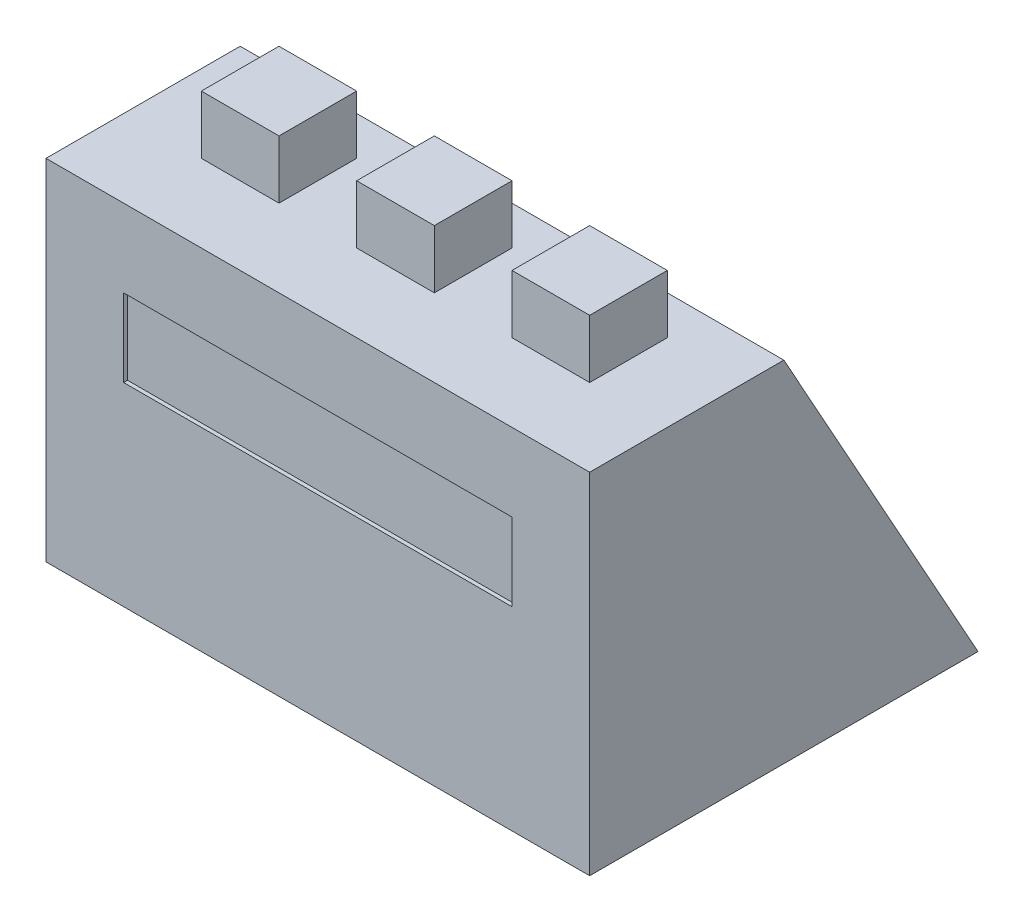
ISO-10303-21;
HEADER;
FILE_DESCRIPTION(('STEP AP214'),'2;1');
FILE_NAME('part.step','',(''),(''),'','','');
FILE_SCHEMA(('AUTOMOTIVE_DESIGN { 1 0 10303 214 1 1 1 1 }'));
ENDSEC;
DATA;
#1=APPLICATION_CONTEXT('core data for automotive mechanical design processes');
#2=APPLICATION_PROTOCOL_DEFINITION('international standard','automotive_design',2000,#1);
#3=PRODUCT_CONTEXT('',#1,'mechanical');
#4=PRODUCT('Part','Part','',(#3));
#5=PRODUCT_RELATED_PRODUCT_CATEGORY('part','',(#4));
#6=PRODUCT_DEFINITION_FORMATION('','',#4);
#7=PRODUCT_DEFINITION_CONTEXT('part definition',#1,'design');
#8=PRODUCT_DEFINITION('design','',#6,#7);
#9=PRODUCT_DEFINITION_SHAPE('','',#8);
#10=(LENGTH_UNIT() NAMED_UNIT(*) SI_UNIT(.MILLI.,.METRE.));
#11=(NAMED_UNIT(*) PLANE_ANGLE_UNIT() SI_UNIT($,.RADIAN.));
#12=(NAMED_UNIT(*) SI_UNIT($,.STERADIAN.) SOLID_ANGLE_UNIT());
#13=UNCERTAINTY_MEASURE_WITH_UNIT(LENGTH_MEASURE(1.E-05),#10,'distance_accuracy_value','');
#14=(GEOMETRIC_REPRESENTATION_CONTEXT(3) GLOBAL_UNCERTAINTY_ASSIGNED_CONTEXT((#13)) GLOBAL_UNIT_ASSIGNED_CONTEXT((#10,
#11,#12)) REPRESENTATION_CONTEXT('',''));
#15=CARTESIAN_POINT('',(0.,0.,0.));
#16=DIRECTION('',(0.,0.,1.));
#17=DIRECTION('',(1.,0.,0.));
#18=AXIS2_PLACEMENT_3D('',#15,#16,#17);
#19=CARTESIAN_POINT('',(100.,105.,-140.772299585195));
#20=DIRECTION('',(-1.,0.,0.));
#21=DIRECTION('',(0.,0.,1.));
#22=AXIS2_PLACEMENT_3D('',#19,#20,#21);
#23=PLANE('',#22);
#24=DIRECTION('',(0.,0.,-1.));
#25=VECTOR('',#24,1.);
#26=CARTESIAN_POINT('',(100.,90.,-140.772299585195));
#27=LINE('',#26,#25);
#28=CARTESIAN_POINT('',(100.,90.,-20.));
#29=VERTEX_POINT('',#28);
#30=CARTESIAN_POINT('',(100.,90.,-40.));
#31=VERTEX_POINT('',#30);
#32=EDGE_CURVE('E97',#29,#31,#27,.T.);
#33=ORIENTED_EDGE('',*,*,#32,.F.);
#34=DIRECTION('',(0.,-1.,0.));
#35=VECTOR('',#34,1.);
#36=CARTESIAN_POINT('',(100.,105.,-20.));
#37=LINE('',#36,#35);
#38=CARTESIAN_POINT('',(100.,105.,-20.));
#39=VERTEX_POINT('',#38);
#40=EDGE_CURVE('E12',#39,#29,#37,.T.);
#41=ORIENTED_EDGE('',*,*,#40,.F.);
#42=DIRECTION('',(0.,0.,-1.));
#43=VECTOR('',#42,1.);
#44=CARTESIAN_POINT('',(100.,105.,-140.772299585195));
#45=LINE('',#44,#43);
#46=CARTESIAN_POINT('',(100.,105.,-40.));
#47=VERTEX_POINT('',#46);
#48=EDGE_CURVE('E106',#39,#47,#45,.T.);
#49=ORIENTED_EDGE('',*,*,#48,.T.);
#50=DIRECTION('',(0.,-1.,0.));
#51=VECTOR('',#50,1.);
#52=CARTESIAN_POINT('',(100.,105.,-40.));
#53=LINE('',#52,#51);
#54=EDGE_CURVE('E57',#47,#31,#53,.T.);
#55=ORIENTED_EDGE('',*,*,#54,.T.);
#56=EDGE_LOOP('',(#33,#41,#49,#55));
#57=FACE_BOUND('',#56,.T.);
#58=ADVANCED_FACE('F43',(#57),#23,.T.);
#59=CARTESIAN_POINT('',(70.,105.,-20.));
#60=DIRECTION('',(0.,0.,-1.));
#61=DIRECTION('',(-1.,0.,0.));
#62=AXIS2_PLACEMENT_3D('',#59,#60,#61);
#63=PLANE('',#62);
#64=DIRECTION('',(1.,0.,0.));
#65=VECTOR('',#64,1.);
#66=CARTESIAN_POINT('',(70.,90.,-20.));
#67=LINE('',#66,#65);
#68=CARTESIAN_POINT('',(120.,90.,-20.));
#69=VERTEX_POINT('',#68);
#70=EDGE_CURVE('E86',#29,#69,#67,.T.);
#71=ORIENTED_EDGE('',*,*,#70,.T.);
#72=DIRECTION('',(0.,-1.,0.));
#73=VECTOR('',#72,1.);
#74=CARTESIAN_POINT('',(120.,105.,-20.));
#75=LINE('',#74,#73);
#76=CARTESIAN_POINT('',(120.,105.,-20.));
#77=VERTEX_POINT('',#76);
#78=EDGE_CURVE('E50',#77,#69,#75,.T.);
#79=ORIENTED_EDGE('',*,*,#78,.F.);
#80=DIRECTION('',(1.,0.,0.));
#81=VECTOR('',#80,1.);
#82=CARTESIAN_POINT('',(70.,105.,-20.));
#83=LINE('',#82,#81);
#84=EDGE_CURVE('E88',#39,#77,#83,.T.);
#85=ORIENTED_EDGE('',*,*,#84,.F.);
#86=ORIENTED_EDGE('',*,*,#40,.T.);
#87=EDGE_LOOP('',(#71,#79,#85,#86));
#88=FACE_BOUND('',#87,.T.);
#89=ADVANCED_FACE('F84',(#88),#63,.F.);
#90=CARTESIAN_POINT('',(120.,105.,-140.772299585195));
#91=DIRECTION('',(-1.,0.,0.));
#92=DIRECTION('',(0.,0.,1.));
#93=AXIS2_PLACEMENT_3D('',#90,#91,#92);
#94=PLANE('',#93);
#95=DIRECTION('',(0.,0.,-1.));
#96=VECTOR('',#95,1.);
#97=CARTESIAN_POINT('',(120.,90.,-140.772299585195));
#98=LINE('',#97,#96);
#99=CARTESIAN_POINT('',(120.,90.,-40.));
#100=VERTEX_POINT('',#99);
#101=EDGE_CURVE('E99',#69,#100,#98,.T.);
#102=ORIENTED_EDGE('',*,*,#101,.T.);
#103=DIRECTION('',(0.,-1.,0.));
#104=VECTOR('',#103,1.);
#105=CARTESIAN_POINT('',(120.,105.,-40.));
#106=LINE('',#105,#104);
#107=CARTESIAN_POINT('',(120.,105.,-40.));
#108=VERTEX_POINT('',#107);
#109=EDGE_CURVE('E113',#108,#100,#106,.T.);
#110=ORIENTED_EDGE('',*,*,#109,.F.);
#111=DIRECTION('',(0.,0.,-1.));
#112=VECTOR('',#111,1.);
#113=CARTESIAN_POINT('',(120.,105.,-140.772299585195));
#114=LINE('',#113,#112);
#115=EDGE_CURVE('E65',#77,#108,#114,.T.);
#116=ORIENTED_EDGE('',*,*,#115,.F.);
#117=ORIENTED_EDGE('',*,*,#78,.T.);
#118=EDGE_LOOP('',(#102,#110,#116,#117));
#119=FACE_BOUND('',#118,.T.);
#120=ADVANCED_FACE('F115',(#119),#94,.F.);
#121=CARTESIAN_POINT('',(70.,105.,-40.));
#122=DIRECTION('',(0.,0.,-1.));
#123=DIRECTION('',(-1.,0.,0.));
#124=AXIS2_PLACEMENT_3D('',#121,#122,#123);
#125=PLANE('',#124);
#126=DIRECTION('',(1.,0.,0.));
#127=VECTOR('',#126,1.);
#128=CARTESIAN_POINT('',(70.,90.,-40.));
#129=LINE('',#128,#127);
#130=EDGE_CURVE('E104',#31,#100,#129,.T.);
#131=ORIENTED_EDGE('',*,*,#130,.F.);
#132=ORIENTED_EDGE('',*,*,#54,.F.);
#133=DIRECTION('',(1.,0.,0.));
#134=VECTOR('',#133,1.);
#135=CARTESIAN_POINT('',(70.,105.,-40.));
#136=LINE('',#135,#134);
#137=EDGE_CURVE('E110',#47,#108,#136,.T.);
#138=ORIENTED_EDGE('',*,*,#137,.T.);
#139=ORIENTED_EDGE('',*,*,#109,.T.);
#140=EDGE_LOOP('',(#131,#132,#138,#139));
#141=FACE_BOUND('',#140,.T.);
#142=ADVANCED_FACE('F116',(#141),#125,.T.);
#143=CARTESIAN_POINT('',(70.,105.,-140.772299585195));
#144=DIRECTION('',(0.,-1.,0.));
#145=DIRECTION('',(0.,0.,-1.));
#146=AXIS2_PLACEMENT_3D('',#143,#144,#145);
#147=PLANE('',#146);
#148=ORIENTED_EDGE('',*,*,#48,.F.);
#149=ORIENTED_EDGE('',*,*,#84,.T.);
#150=ORIENTED_EDGE('',*,*,#115,.T.);
#151=ORIENTED_EDGE('',*,*,#137,.F.);
#152=EDGE_LOOP('',(#148,#149,#150,#151));
#153=FACE_BOUND('',#152,.T.);
#154=ADVANCED_FACE('F117',(#153),#147,.F.);
#155=CARTESIAN_POINT('',(70.,90.,-140.772299585195));
#156=DIRECTION('',(0.,-1.,0.));
#157=DIRECTION('',(0.,0.,-1.));
#158=AXIS2_PLACEMENT_3D('',#155,#156,#157);
#159=PLANE('',#158);
#160=ORIENTED_EDGE('',*,*,#32,.T.);
#161=ORIENTED_EDGE('',*,*,#130,.T.);
#162=ORIENTED_EDGE('',*,*,#101,.F.);
#163=ORIENTED_EDGE('',*,*,#70,.F.);
#164=EDGE_LOOP('',(#160,#161,#162,#163));
#165=FACE_BOUND('',#164,.T.);
#166=ADVANCED_FACE('F95',(#165),#159,.T.);
#167=CLOSED_SHELL('',(#58,#89,#120,#142,#154,#166));
#168=MANIFOLD_SOLID_BREP('B2',#167);
#169=CARTESIAN_POINT('',(70.,105.,-40.));
#170=DIRECTION('',(0.,0.,-1.));
#171=DIRECTION('',(-1.,0.,0.));
#172=AXIS2_PLACEMENT_3D('',#169,#170,#171);
#173=PLANE('',#172);
#174=DIRECTION('',(1.,0.,0.));
#175=VECTOR('',#174,1.);
#176=CARTESIAN_POINT('',(70.,90.,-40.));
#177=LINE('',#176,#175);
#178=CARTESIAN_POINT('',(60.,90.,-40.));
#179=VERTEX_POINT('',#178);
#180=CARTESIAN_POINT('',(80.,90.,-40.));
#181=VERTEX_POINT('',#180);
#182=EDGE_CURVE('E224',#179,#181,#177,.T.);
#183=ORIENTED_EDGE('',*,*,#182,.F.);
#184=DIRECTION('',(0.,-1.,0.));
#185=VECTOR('',#184,1.);
#186=CARTESIAN_POINT('',(60.,105.,-40.));
#187=LINE('',#186,#185);
#188=CARTESIAN_POINT('',(60.,105.,-40.));
#189=VERTEX_POINT('',#188);
#190=EDGE_CURVE('E41',#189,#179,#187,.T.);
#191=ORIENTED_EDGE('',*,*,#190,.F.);
#192=DIRECTION('',(1.,0.,0.));
#193=VECTOR('',#192,1.);
#194=CARTESIAN_POINT('',(70.,105.,-40.));
#195=LINE('',#194,#193);
#196=CARTESIAN_POINT('',(80.,105.,-40.));
#197=VERTEX_POINT('',#196);
#198=EDGE_CURVE('E238',#189,#197,#195,.T.);
#199=ORIENTED_EDGE('',*,*,#198,.T.);
#200=DIRECTION('',(0.,-1.,0.));
#201=VECTOR('',#200,1.);
#202=CARTESIAN_POINT('',(80.,105.,-40.));
#203=LINE('',#202,#201);
#204=EDGE_CURVE('E225',#197,#181,#203,.T.);
#205=ORIENTED_EDGE('',*,*,#204,.T.);
#206=EDGE_LOOP('',(#183,#191,#199,#205));
#207=FACE_BOUND('',#206,.T.);
#208=ADVANCED_FACE('F176',(#207),#173,.T.);
#209=CARTESIAN_POINT('',(60.,105.,-140.772299585195));
#210=DIRECTION('',(-1.,0.,0.));
#211=DIRECTION('',(0.,0.,1.));
#212=AXIS2_PLACEMENT_3D('',#209,#210,#211);
#213=PLANE('',#212);
#214=DIRECTION('',(0.,0.,-1.));
#215=VECTOR('',#214,1.);
#216=CARTESIAN_POINT('',(60.,90.,-140.772299585195));
#217=LINE('',#216,#215);
#218=CARTESIAN_POINT('',(60.,90.,-20.));
#219=VERTEX_POINT('',#218);
#220=EDGE_CURVE('E219',#219,#179,#217,.T.);
#221=ORIENTED_EDGE('',*,*,#220,.F.);
#222=DIRECTION('',(0.,-1.,0.));
#223=VECTOR('',#222,1.);
#224=CARTESIAN_POINT('',(60.,105.,-20.));
#225=LINE('',#224,#223);
#226=CARTESIAN_POINT('',(60.,105.,-20.));
#227=VERTEX_POINT('',#226);
#228=EDGE_CURVE('E183',#227,#219,#225,.T.);
#229=ORIENTED_EDGE('',*,*,#228,.F.);
#230=DIRECTION('',(0.,0.,-1.));
#231=VECTOR('',#230,1.);
#232=CARTESIAN_POINT('',(60.,105.,-140.772299585195));
#233=LINE('',#232,#231);
#234=EDGE_CURVE('E220',#227,#189,#233,.T.);
#235=ORIENTED_EDGE('',*,*,#234,.T.);
#236=ORIENTED_EDGE('',*,*,#190,.T.);
#237=EDGE_LOOP('',(#221,#229,#235,#236));
#238=FACE_BOUND('',#237,.T.);
#239=ADVANCED_FACE('F217',(#238),#213,.T.);
#240=CARTESIAN_POINT('',(70.,105.,-20.));
#241=DIRECTION('',(0.,0.,-1.));
#242=DIRECTION('',(-1.,0.,0.));
#243=AXIS2_PLACEMENT_3D('',#240,#241,#242);
#244=PLANE('',#243);
#245=DIRECTION('',(1.,0.,0.));
#246=VECTOR('',#245,1.);
#247=CARTESIAN_POINT('',(70.,90.,-20.));
#248=LINE('',#247,#246);
#249=CARTESIAN_POINT('',(80.,90.,-20.));
#250=VERTEX_POINT('',#249);
#251=EDGE_CURVE('E232',#219,#250,#248,.T.);
#252=ORIENTED_EDGE('',*,*,#251,.T.);
#253=DIRECTION('',(0.,-1.,0.));
#254=VECTOR('',#253,1.);
#255=CARTESIAN_POINT('',(80.,105.,-20.));
#256=LINE('',#255,#254);
#257=CARTESIAN_POINT('',(80.,105.,-20.));
#258=VERTEX_POINT('',#257);
#259=EDGE_CURVE('E244',#258,#250,#256,.T.);
#260=ORIENTED_EDGE('',*,*,#259,.F.);
#261=DIRECTION('',(1.,0.,0.));
#262=VECTOR('',#261,1.);
#263=CARTESIAN_POINT('',(70.,105.,-20.));
#264=LINE('',#263,#262);
#265=EDGE_CURVE('E195',#227,#258,#264,.T.);
#266=ORIENTED_EDGE('',*,*,#265,.F.);
#267=ORIENTED_EDGE('',*,*,#228,.T.);
#268=EDGE_LOOP('',(#252,#260,#266,#267));
#269=FACE_BOUND('',#268,.T.);
#270=ADVANCED_FACE('F247',(#269),#244,.F.);
#271=CARTESIAN_POINT('',(80.,105.,-140.772299585195));
#272=DIRECTION('',(-1.,0.,0.));
#273=DIRECTION('',(0.,0.,1.));
#274=AXIS2_PLACEMENT_3D('',#271,#272,#273);
#275=PLANE('',#274);
#276=DIRECTION('',(0.,0.,-1.));
#277=VECTOR('',#276,1.);
#278=CARTESIAN_POINT('',(80.,90.,-140.772299585195));
#279=LINE('',#278,#277);
#280=EDGE_CURVE('E234',#250,#181,#279,.T.);
#281=ORIENTED_EDGE('',*,*,#280,.T.);
#282=ORIENTED_EDGE('',*,*,#204,.F.);
#283=DIRECTION('',(0.,0.,-1.));
#284=VECTOR('',#283,1.);
#285=CARTESIAN_POINT('',(80.,105.,-140.772299585195));
#286=LINE('',#285,#284);
#287=EDGE_CURVE('E190',#258,#197,#286,.T.);
#288=ORIENTED_EDGE('',*,*,#287,.F.);
#289=ORIENTED_EDGE('',*,*,#259,.T.);
#290=EDGE_LOOP('',(#281,#282,#288,#289));
#291=FACE_BOUND('',#290,.T.);
#292=ADVANCED_FACE('F250',(#291),#275,.F.);
#293=CARTESIAN_POINT('',(70.,105.,-140.772299585195));
#294=DIRECTION('',(0.,-1.,0.));
#295=DIRECTION('',(0.,0.,-1.));
#296=AXIS2_PLACEMENT_3D('',#293,#294,#295);
#297=PLANE('',#296);
#298=ORIENTED_EDGE('',*,*,#198,.F.);
#299=ORIENTED_EDGE('',*,*,#234,.F.);
#300=ORIENTED_EDGE('',*,*,#265,.T.);
#301=ORIENTED_EDGE('',*,*,#287,.T.);
#302=EDGE_LOOP('',(#298,#299,#300,#301));
#303=FACE_BOUND('',#302,.T.);
#304=ADVANCED_FACE('F248',(#303),#297,.F.);
#305=CARTESIAN_POINT('',(70.,90.,-140.772299585195));
#306=DIRECTION('',(0.,-1.,0.));
#307=DIRECTION('',(0.,0.,-1.));
#308=AXIS2_PLACEMENT_3D('',#305,#306,#307);
#309=PLANE('',#308);
#310=ORIENTED_EDGE('',*,*,#182,.T.);
#311=ORIENTED_EDGE('',*,*,#280,.F.);
#312=ORIENTED_EDGE('',*,*,#251,.F.);
#313=ORIENTED_EDGE('',*,*,#220,.T.);
#314=EDGE_LOOP('',(#310,#311,#312,#313));
#315=FACE_BOUND('',#314,.T.);
#316=ADVANCED_FACE('F231',(#315),#309,.T.);
#317=CLOSED_SHELL('',(#208,#239,#270,#292,#304,#316));
#318=MANIFOLD_SOLID_BREP('B6',#317);
#319=CARTESIAN_POINT('',(70.,105.,-40.));
#320=DIRECTION('',(0.,0.,-1.));
#321=DIRECTION('',(-1.,0.,0.));
#322=AXIS2_PLACEMENT_3D('',#319,#320,#321);
#323=PLANE('',#322);
#324=DIRECTION('',(1.,0.,0.));
#325=VECTOR('',#324,1.);
#326=CARTESIAN_POINT('',(70.,90.,-40.));
#327=LINE('',#326,#325);
#328=CARTESIAN_POINT('',(20.,90.,-40.));
#329=VERTEX_POINT('',#328);
#330=CARTESIAN_POINT('',(40.,90.,-40.));
#331=VERTEX_POINT('',#330);
#332=EDGE_CURVE('E356',#329,#331,#327,.T.);
#333=ORIENTED_EDGE('',*,*,#332,.F.);
#334=DIRECTION('',(0.,-1.,0.));
#335=VECTOR('',#334,1.);
#336=CARTESIAN_POINT('',(20.,105.,-40.));
#337=LINE('',#336,#335);
#338=CARTESIAN_POINT('',(20.,105.,-40.));
#339=VERTEX_POINT('',#338);
#340=EDGE_CURVE('E174',#339,#329,#337,.T.);
#341=ORIENTED_EDGE('',*,*,#340,.F.);
#342=DIRECTION('',(1.,0.,0.));
#343=VECTOR('',#342,1.);
#344=CARTESIAN_POINT('',(70.,105.,-40.));
#345=LINE('',#344,#343);
#346=CARTESIAN_POINT('',(40.,105.,-40.));
#347=VERTEX_POINT('',#346);
#348=EDGE_CURVE('E370',#339,#347,#345,.T.);
#349=ORIENTED_EDGE('',*,*,#348,.T.);
#350=DIRECTION('',(0.,-1.,0.));
#351=VECTOR('',#350,1.);
#352=CARTESIAN_POINT('',(40.,105.,-40.));
#353=LINE('',#352,#351);
#354=EDGE_CURVE('E357',#347,#331,#353,.T.);
#355=ORIENTED_EDGE('',*,*,#354,.T.);
#356=EDGE_LOOP('',(#333,#341,#349,#355));
#357=FACE_BOUND('',#356,.T.);
#358=ADVANCED_FACE('F308',(#357),#323,.T.);
#359=CARTESIAN_POINT('',(19.9999999999999,105.,-140.772299585195));
#360=DIRECTION('',(-1.,0.,0.));
#361=DIRECTION('',(0.,0.,1.));
#362=AXIS2_PLACEMENT_3D('',#359,#360,#361);
#363=PLANE('',#362);
#364=DIRECTION('',(0.,0.,-1.));
#365=VECTOR('',#364,1.);
#366=CARTESIAN_POINT('',(19.9999999999999,90.,-140.772299585195));
#367=LINE('',#366,#365);
#368=CARTESIAN_POINT('',(20.,90.,-20.));
#369=VERTEX_POINT('',#368);
#370=EDGE_CURVE('E351',#369,#329,#367,.T.);
#371=ORIENTED_EDGE('',*,*,#370,.F.);
#372=DIRECTION('',(0.,-1.,0.));
#373=VECTOR('',#372,1.);
#374=CARTESIAN_POINT('',(20.,105.,-20.));
#375=LINE('',#374,#373);
#376=CARTESIAN_POINT('',(20.,105.,-20.));
#377=VERTEX_POINT('',#376);
#378=EDGE_CURVE('E315',#377,#369,#375,.T.);
#379=ORIENTED_EDGE('',*,*,#378,.F.);
#380=DIRECTION('',(0.,0.,-1.));
#381=VECTOR('',#380,1.);
#382=CARTESIAN_POINT('',(19.9999999999999,105.,-140.772299585195));
#383=LINE('',#382,#381);
#384=EDGE_CURVE('E352',#377,#339,#383,.T.);
#385=ORIENTED_EDGE('',*,*,#384,.T.);
#386=ORIENTED_EDGE('',*,*,#340,.T.);
#387=EDGE_LOOP('',(#371,#379,#385,#386));
#388=FACE_BOUND('',#387,.T.);
#389=ADVANCED_FACE('F349',(#388),#363,.T.);
#390=CARTESIAN_POINT('',(70.,105.,-20.));
#391=DIRECTION('',(0.,0.,-1.));
#392=DIRECTION('',(-1.,0.,0.));
#393=AXIS2_PLACEMENT_3D('',#390,#391,#392);
#394=PLANE('',#393);
#395=DIRECTION('',(1.,0.,0.));
#396=VECTOR('',#395,1.);
#397=CARTESIAN_POINT('',(70.,90.,-20.));
#398=LINE('',#397,#396);
#399=CARTESIAN_POINT('',(40.,90.,-20.));
#400=VERTEX_POINT('',#399);
#401=EDGE_CURVE('E364',#369,#400,#398,.T.);
#402=ORIENTED_EDGE('',*,*,#401,.T.);
#403=DIRECTION('',(0.,-1.,0.));
#404=VECTOR('',#403,1.);
#405=CARTESIAN_POINT('',(40.,105.,-20.));
#406=LINE('',#405,#404);
#407=CARTESIAN_POINT('',(40.,105.,-20.));
#408=VERTEX_POINT('',#407);
#409=EDGE_CURVE('E376',#408,#400,#406,.T.);
#410=ORIENTED_EDGE('',*,*,#409,.F.);
#411=DIRECTION('',(1.,0.,0.));
#412=VECTOR('',#411,1.);
#413=CARTESIAN_POINT('',(70.,105.,-20.));
#414=LINE('',#413,#412);
#415=EDGE_CURVE('E327',#377,#408,#414,.T.);
#416=ORIENTED_EDGE('',*,*,#415,.F.);
#417=ORIENTED_EDGE('',*,*,#378,.T.);
#418=EDGE_LOOP('',(#402,#410,#416,#417));
#419=FACE_BOUND('',#418,.T.);
#420=ADVANCED_FACE('F379',(#419),#394,.F.);
#421=CARTESIAN_POINT('',(40.,105.,-140.772299585195));
#422=DIRECTION('',(-1.,0.,0.));
#423=DIRECTION('',(0.,0.,1.));
#424=AXIS2_PLACEMENT_3D('',#421,#422,#423);
#425=PLANE('',#424);
#426=DIRECTION('',(0.,0.,-1.));
#427=VECTOR('',#426,1.);
#428=CARTESIAN_POINT('',(40.,90.,-140.772299585195));
#429=LINE('',#428,#427);
#430=EDGE_CURVE('E366',#400,#331,#429,.T.);
#431=ORIENTED_EDGE('',*,*,#430,.T.);
#432=ORIENTED_EDGE('',*,*,#354,.F.);
#433=DIRECTION('',(0.,0.,-1.));
#434=VECTOR('',#433,1.);
#435=CARTESIAN_POINT('',(40.,105.,-140.772299585195));
#436=LINE('',#435,#434);
#437=EDGE_CURVE('E322',#408,#347,#436,.T.);
#438=ORIENTED_EDGE('',*,*,#437,.F.);
#439=ORIENTED_EDGE('',*,*,#409,.T.);
#440=EDGE_LOOP('',(#431,#432,#438,#439));
#441=FACE_BOUND('',#440,.T.);
#442=ADVANCED_FACE('F382',(#441),#425,.F.);
#443=CARTESIAN_POINT('',(70.,105.,-140.772299585195));
#444=DIRECTION('',(0.,-1.,0.));
#445=DIRECTION('',(0.,0.,-1.));
#446=AXIS2_PLACEMENT_3D('',#443,#444,#445);
#447=PLANE('',#446);
#448=ORIENTED_EDGE('',*,*,#348,.F.);
#449=ORIENTED_EDGE('',*,*,#384,.F.);
#450=ORIENTED_EDGE('',*,*,#415,.T.);
#451=ORIENTED_EDGE('',*,*,#437,.T.);
#452=EDGE_LOOP('',(#448,#449,#450,#451));
#453=FACE_BOUND('',#452,.T.);
#454=ADVANCED_FACE('F380',(#453),#447,.F.);
#455=CARTESIAN_POINT('',(70.,90.,-140.772299585195));
#456=DIRECTION('',(0.,-1.,0.));
#457=DIRECTION('',(0.,0.,-1.));
#458=AXIS2_PLACEMENT_3D('',#455,#456,#457);
#459=PLANE('',#458);
#460=ORIENTED_EDGE('',*,*,#332,.T.);
#461=ORIENTED_EDGE('',*,*,#430,.F.);
#462=ORIENTED_EDGE('',*,*,#401,.F.);
#463=ORIENTED_EDGE('',*,*,#370,.T.);
#464=EDGE_LOOP('',(#460,#461,#462,#463));
#465=FACE_BOUND('',#464,.T.);
#466=ADVANCED_FACE('F363',(#465),#459,.T.);
#467=CLOSED_SHELL('',(#358,#389,#420,#442,#454,#466));
#468=MANIFOLD_SOLID_BREP('B35',#467);
#469=CARTESIAN_POINT('',(140.,90.,-50.));
#470=DIRECTION('',(0.,-1.,0.));
#471=DIRECTION('',(0.,0.,-1.));
#472=AXIS2_PLACEMENT_3D('',#469,#470,#471);
#473=PLANE('',#472);
#474=DIRECTION('',(0.,0.,1.));
#475=VECTOR('',#474,1.);
#476=CARTESIAN_POINT('',(0.,90.,-50.));
#477=LINE('',#476,#475);
#478=CARTESIAN_POINT('',(0.,90.,-50.));
#479=VERTEX_POINT('',#478);
#480=CARTESIAN_POINT('',(0.,90.,0.));
#481=VERTEX_POINT('',#480);
#482=EDGE_CURVE('E534',#479,#481,#477,.T.);
#483=ORIENTED_EDGE('',*,*,#482,.T.);
#484=DIRECTION('',(-1.,0.,0.));
#485=VECTOR('',#484,1.);
#486=CARTESIAN_POINT('',(140.,90.,0.));
#487=LINE('',#486,#485);
#488=CARTESIAN_POINT('',(140.,90.,0.));
#489=VERTEX_POINT('',#488);
#490=EDGE_CURVE('E306',#489,#481,#487,.T.);
#491=ORIENTED_EDGE('',*,*,#490,.F.);
#492=DIRECTION('',(0.,0.,1.));
#493=VECTOR('',#492,1.);
#494=CARTESIAN_POINT('',(140.,90.,-50.));
#495=LINE('',#494,#493);
#496=CARTESIAN_POINT('',(140.,90.,-50.));
#497=VERTEX_POINT('',#496);
#498=EDGE_CURVE('E545',#497,#489,#495,.T.);
#499=ORIENTED_EDGE('',*,*,#498,.F.);
#500=DIRECTION('',(-1.,0.,0.));
#501=VECTOR('',#500,1.);
#502=CARTESIAN_POINT('',(140.,90.,-50.));
#503=LINE('',#502,#501);
#504=EDGE_CURVE('E552',#497,#479,#503,.T.);
#505=ORIENTED_EDGE('',*,*,#504,.T.);
#506=EDGE_LOOP('',(#483,#491,#499,#505));
#507=FACE_BOUND('',#506,.T.);
#508=ADVANCED_FACE('F431',(#507),#473,.F.);
#509=CARTESIAN_POINT('',(140.,90.,0.));
#510=DIRECTION('',(0.,0.,-1.));
#511=DIRECTION('',(0.,1.,0.));
#512=AXIS2_PLACEMENT_3D('',#509,#510,#511);
#513=PLANE('',#512);
#514=DIRECTION('',(-1.,0.,0.));
#515=VECTOR('',#514,1.);
#516=CARTESIAN_POINT('',(20.,70.,0.));
#517=LINE('',#516,#515);
#518=CARTESIAN_POINT('',(120.,70.,0.));
#519=VERTEX_POINT('',#518);
#520=CARTESIAN_POINT('',(20.,70.,0.));
#521=VERTEX_POINT('',#520);
#522=EDGE_CURVE('E511',#519,#521,#517,.T.);
#523=ORIENTED_EDGE('',*,*,#522,.F.);
#524=DIRECTION('',(0.,1.,0.));
#525=VECTOR('',#524,1.);
#526=CARTESIAN_POINT('',(120.,50.,0.));
#527=LINE('',#526,#525);
#528=CARTESIAN_POINT('',(120.,50.,0.));
#529=VERTEX_POINT('',#528);
#530=EDGE_CURVE('E445',#529,#519,#527,.T.);
#531=ORIENTED_EDGE('',*,*,#530,.F.);
#532=DIRECTION('',(1.,0.,0.));
#533=VECTOR('',#532,1.);
#534=CARTESIAN_POINT('',(20.,50.,0.));
#535=LINE('',#534,#533);
#536=CARTESIAN_POINT('',(20.,50.,0.));
#537=VERTEX_POINT('',#536);
#538=EDGE_CURVE('E518',#537,#529,#535,.T.);
#539=ORIENTED_EDGE('',*,*,#538,.F.);
#540=DIRECTION('',(0.,-1.,0.));
#541=VECTOR('',#540,1.);
#542=CARTESIAN_POINT('',(20.,50.,0.));
#543=LINE('',#542,#541);
#544=EDGE_CURVE('E500',#521,#537,#543,.T.);
#545=ORIENTED_EDGE('',*,*,#544,.F.);
#546=EDGE_LOOP('',(#523,#531,#539,#545));
#547=FACE_BOUND('',#546,.T.);
#548=DIRECTION('',(0.,-1.,0.));
#549=VECTOR('',#548,1.);
#550=CARTESIAN_POINT('',(0.,90.,0.));
#551=LINE('',#550,#549);
#552=CARTESIAN_POINT('',(0.,0.,0.));
#553=VERTEX_POINT('',#552);
#554=EDGE_CURVE('E539',#481,#553,#551,.T.);
#555=ORIENTED_EDGE('',*,*,#554,.T.);
#556=DIRECTION('',(-1.,0.,0.));
#557=VECTOR('',#556,1.);
#558=CARTESIAN_POINT('',(140.,0.,0.));
#559=LINE('',#558,#557);
#560=CARTESIAN_POINT('',(140.,0.,0.));
#561=VERTEX_POINT('',#560);
#562=EDGE_CURVE('E438',#561,#553,#559,.T.);
#563=ORIENTED_EDGE('',*,*,#562,.F.);
#564=DIRECTION('',(0.,-1.,0.));
#565=VECTOR('',#564,1.);
#566=CARTESIAN_POINT('',(140.,90.,0.));
#567=LINE('',#566,#565);
#568=EDGE_CURVE('E547',#489,#561,#567,.T.);
#569=ORIENTED_EDGE('',*,*,#568,.F.);
#570=ORIENTED_EDGE('',*,*,#490,.T.);
#571=EDGE_LOOP('',(#555,#563,#569,#570));
#572=FACE_BOUND('',#571,.T.);
#573=ADVANCED_FACE('F515',(#547,#572),#513,.F.);
#574=CARTESIAN_POINT('',(140.,0.,0.));
#575=DIRECTION('',(0.,1.,0.));
#576=DIRECTION('',(0.,0.,1.));
#577=AXIS2_PLACEMENT_3D('',#574,#575,#576);
#578=PLANE('',#577);
#579=DIRECTION('',(0.,0.,-1.));
#580=VECTOR('',#579,1.);
#581=CARTESIAN_POINT('',(0.,0.,0.));
#582=LINE('',#581,#580);
#583=CARTESIAN_POINT('',(0.,0.,-100.));
#584=VERTEX_POINT('',#583);
#585=EDGE_CURVE('E541',#553,#584,#582,.T.);
#586=ORIENTED_EDGE('',*,*,#585,.T.);
#587=DIRECTION('',(-1.,0.,0.));
#588=VECTOR('',#587,1.);
#589=CARTESIAN_POINT('',(140.,0.,-100.));
#590=LINE('',#589,#588);
#591=CARTESIAN_POINT('',(140.,0.,-100.));
#592=VERTEX_POINT('',#591);
#593=EDGE_CURVE('E555',#592,#584,#590,.T.);
#594=ORIENTED_EDGE('',*,*,#593,.F.);
#595=DIRECTION('',(0.,0.,-1.));
#596=VECTOR('',#595,1.);
#597=CARTESIAN_POINT('',(140.,0.,0.));
#598=LINE('',#597,#596);
#599=EDGE_CURVE('E549',#561,#592,#598,.T.);
#600=ORIENTED_EDGE('',*,*,#599,.F.);
#601=ORIENTED_EDGE('',*,*,#562,.T.);
#602=EDGE_LOOP('',(#586,#594,#600,#601));
#603=FACE_BOUND('',#602,.T.);
#604=ADVANCED_FACE('F562',(#603),#578,.F.);
#605=CARTESIAN_POINT('',(140.,0.,-100.));
#606=DIRECTION('',(0.,-0.485642931178632,0.874157276121538));
#607=DIRECTION('',(0.,-0.874157276121538,-0.485642931178632));
#608=AXIS2_PLACEMENT_3D('',#605,#606,#607);
#609=PLANE('',#608);
#610=DIRECTION('',(0.,0.874157276121538,0.485642931178632));
#611=VECTOR('',#610,1.);
#612=CARTESIAN_POINT('',(0.,0.,-100.));
#613=LINE('',#612,#611);
#614=EDGE_CURVE('E543',#584,#479,#613,.T.);
#615=ORIENTED_EDGE('',*,*,#614,.T.);
#616=ORIENTED_EDGE('',*,*,#504,.F.);
#617=DIRECTION('',(0.,0.874157276121538,0.485642931178632));
#618=VECTOR('',#617,1.);
#619=CARTESIAN_POINT('',(140.,0.,-100.));
#620=LINE('',#619,#618);
#621=EDGE_CURVE('E453',#592,#497,#620,.T.);
#622=ORIENTED_EDGE('',*,*,#621,.F.);
#623=ORIENTED_EDGE('',*,*,#593,.T.);
#624=EDGE_LOOP('',(#615,#616,#622,#623));
#625=FACE_BOUND('',#624,.T.);
#626=ADVANCED_FACE('F569',(#625),#609,.F.);
#627=CARTESIAN_POINT('',(140.,90.,0.));
#628=DIRECTION('',(1.,0.,0.));
#629=DIRECTION('',(0.,0.,-1.));
#630=AXIS2_PLACEMENT_3D('',#627,#628,#629);
#631=PLANE('',#630);
#632=ORIENTED_EDGE('',*,*,#498,.T.);
#633=ORIENTED_EDGE('',*,*,#568,.T.);
#634=ORIENTED_EDGE('',*,*,#599,.T.);
#635=ORIENTED_EDGE('',*,*,#621,.T.);
#636=EDGE_LOOP('',(#632,#633,#634,#635));
#637=FACE_BOUND('',#636,.T.);
#638=ADVANCED_FACE('F573',(#637),#631,.T.);
#639=CARTESIAN_POINT('',(0.,90.,0.));
#640=DIRECTION('',(1.,0.,0.));
#641=DIRECTION('',(0.,0.,-1.));
#642=AXIS2_PLACEMENT_3D('',#639,#640,#641);
#643=PLANE('',#642);
#644=ORIENTED_EDGE('',*,*,#482,.F.);
#645=ORIENTED_EDGE('',*,*,#614,.F.);
#646=ORIENTED_EDGE('',*,*,#585,.F.);
#647=ORIENTED_EDGE('',*,*,#554,.F.);
#648=EDGE_LOOP('',(#644,#645,#646,#647));
#649=FACE_BOUND('',#648,.T.);
#650=ADVANCED_FACE('F567',(#649),#643,.F.);
#651=CARTESIAN_POINT('',(120.,50.,-1.));
#652=DIRECTION('',(1.,0.,0.));
#653=DIRECTION('',(0.,0.,-1.));
#654=AXIS2_PLACEMENT_3D('',#651,#652,#653);
#655=PLANE('',#654);
#656=ORIENTED_EDGE('',*,*,#530,.T.);
#657=DIRECTION('',(0.,0.,1.));
#658=VECTOR('',#657,1.);
#659=CARTESIAN_POINT('',(120.,70.,-1.));
#660=LINE('',#659,#658);
#661=CARTESIAN_POINT('',(120.,70.,-1.));
#662=VERTEX_POINT('',#661);
#663=EDGE_CURVE('E508',#662,#519,#660,.T.);
#664=ORIENTED_EDGE('',*,*,#663,.F.);
#665=DIRECTION('',(0.,1.,0.));
#666=VECTOR('',#665,1.);
#667=CARTESIAN_POINT('',(120.,50.,-1.));
#668=LINE('',#667,#666);
#669=CARTESIAN_POINT('',(120.,50.,-1.));
#670=VERTEX_POINT('',#669);
#671=EDGE_CURVE('E520',#670,#662,#668,.T.);
#672=ORIENTED_EDGE('',*,*,#671,.F.);
#673=DIRECTION('',(0.,0.,1.));
#674=VECTOR('',#673,1.);
#675=CARTESIAN_POINT('',(120.,50.,-1.));
#676=LINE('',#675,#674);
#677=EDGE_CURVE('E532',#670,#529,#676,.T.);
#678=ORIENTED_EDGE('',*,*,#677,.T.);
#679=EDGE_LOOP('',(#656,#664,#672,#678));
#680=FACE_BOUND('',#679,.T.);
#681=ADVANCED_FACE('F587',(#680),#655,.F.);
#682=CARTESIAN_POINT('',(20.,50.,-1.));
#683=DIRECTION('',(0.,-1.,0.));
#684=DIRECTION('',(1.,0.,0.));
#685=AXIS2_PLACEMENT_3D('',#682,#683,#684);
#686=PLANE('',#685);
#687=ORIENTED_EDGE('',*,*,#538,.T.);
#688=ORIENTED_EDGE('',*,*,#677,.F.);
#689=DIRECTION('',(1.,0.,0.));
#690=VECTOR('',#689,1.);
#691=CARTESIAN_POINT('',(20.,50.,-1.));
#692=LINE('',#691,#690);
#693=CARTESIAN_POINT('',(20.,50.,-1.));
#694=VERTEX_POINT('',#693);
#695=EDGE_CURVE('E529',#694,#670,#692,.T.);
#696=ORIENTED_EDGE('',*,*,#695,.F.);
#697=DIRECTION('',(0.,0.,1.));
#698=VECTOR('',#697,1.);
#699=CARTESIAN_POINT('',(20.,50.,-1.));
#700=LINE('',#699,#698);
#701=EDGE_CURVE('E507',#694,#537,#700,.T.);
#702=ORIENTED_EDGE('',*,*,#701,.T.);
#703=EDGE_LOOP('',(#687,#688,#696,#702));
#704=FACE_BOUND('',#703,.T.);
#705=ADVANCED_FACE('F590',(#704),#686,.F.);
#706=CARTESIAN_POINT('',(20.,50.,-1.));
#707=DIRECTION('',(-1.,0.,0.));
#708=DIRECTION('',(0.,-1.,0.));
#709=AXIS2_PLACEMENT_3D('',#706,#707,#708);
#710=PLANE('',#709);
#711=ORIENTED_EDGE('',*,*,#544,.T.);
#712=ORIENTED_EDGE('',*,*,#701,.F.);
#713=DIRECTION('',(0.,-1.,0.));
#714=VECTOR('',#713,1.);
#715=CARTESIAN_POINT('',(20.,50.,-1.));
#716=LINE('',#715,#714);
#717=CARTESIAN_POINT('',(20.,70.,-1.));
#718=VERTEX_POINT('',#717);
#719=EDGE_CURVE('E503',#718,#694,#716,.T.);
#720=ORIENTED_EDGE('',*,*,#719,.F.);
#721=DIRECTION('',(0.,0.,1.));
#722=VECTOR('',#721,1.);
#723=CARTESIAN_POINT('',(20.,70.,-1.));
#724=LINE('',#723,#722);
#725=EDGE_CURVE('E496',#718,#521,#724,.T.);
#726=ORIENTED_EDGE('',*,*,#725,.T.);
#727=EDGE_LOOP('',(#711,#712,#720,#726));
#728=FACE_BOUND('',#727,.T.);
#729=ADVANCED_FACE('F498',(#728),#710,.F.);
#730=CARTESIAN_POINT('',(20.,70.,-1.));
#731=DIRECTION('',(0.,1.,0.));
#732=DIRECTION('',(-1.,0.,0.));
#733=AXIS2_PLACEMENT_3D('',#730,#731,#732);
#734=PLANE('',#733);
#735=ORIENTED_EDGE('',*,*,#522,.T.);
#736=ORIENTED_EDGE('',*,*,#725,.F.);
#737=DIRECTION('',(-1.,0.,0.));
#738=VECTOR('',#737,1.);
#739=CARTESIAN_POINT('',(20.,70.,-1.));
#740=LINE('',#739,#738);
#741=EDGE_CURVE('E526',#662,#718,#740,.T.);
#742=ORIENTED_EDGE('',*,*,#741,.F.);
#743=ORIENTED_EDGE('',*,*,#663,.T.);
#744=EDGE_LOOP('',(#735,#736,#742,#743));
#745=FACE_BOUND('',#744,.T.);
#746=ADVANCED_FACE('F512',(#745),#734,.F.);
#747=CARTESIAN_POINT('',(120.,50.,-1.));
#748=DIRECTION('',(0.,0.,-1.));
#749=DIRECTION('',(-1.,0.,0.));
#750=AXIS2_PLACEMENT_3D('',#747,#748,#749);
#751=PLANE('',#750);
#752=ORIENTED_EDGE('',*,*,#671,.T.);
#753=ORIENTED_EDGE('',*,*,#741,.T.);
#754=ORIENTED_EDGE('',*,*,#719,.T.);
#755=ORIENTED_EDGE('',*,*,#695,.T.);
#756=EDGE_LOOP('',(#752,#753,#754,#755));
#757=FACE_BOUND('',#756,.T.);
#758=ADVANCED_FACE('F593',(#757),#751,.F.);
#759=CLOSED_SHELL('',(#508,#573,#604,#626,#638,#650,#681,#705,#729,#746,#758));
#760=MANIFOLD_SOLID_BREP('B168',#759);
#761=ADVANCED_BREP_SHAPE_REPRESENTATION('',(#18,#168,#318,#468,#760),#14);
#762=SHAPE_DEFINITION_REPRESENTATION(#9,#761);
ENDSEC;
END-ISO-10303-21;
